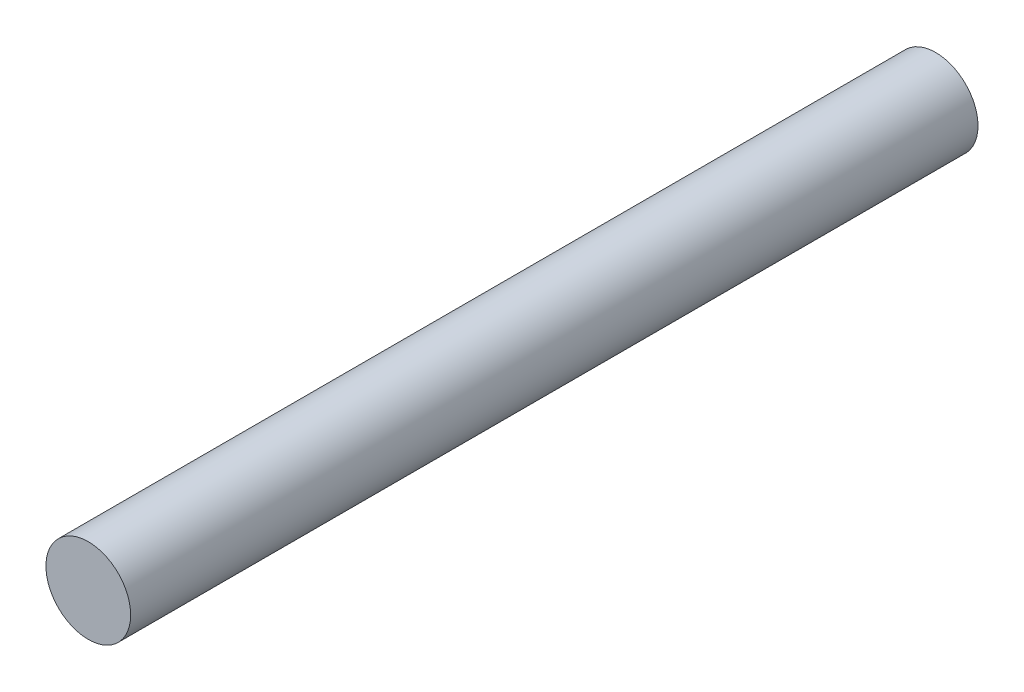
ISO-10303-21;
HEADER;
FILE_DESCRIPTION(('STEP AP214'),'2;1');
FILE_NAME('part.step','',(''),(''),'','','');
FILE_SCHEMA(('AUTOMOTIVE_DESIGN { 1 0 10303 214 1 1 1 1 }'));
ENDSEC;
DATA;
#1=APPLICATION_CONTEXT('core data for automotive mechanical design processes');
#2=APPLICATION_PROTOCOL_DEFINITION('international standard','automotive_design',2000,#1);
#3=PRODUCT_CONTEXT('',#1,'mechanical');
#4=PRODUCT('Part','Part','',(#3));
#5=PRODUCT_RELATED_PRODUCT_CATEGORY('part','',(#4));
#6=PRODUCT_DEFINITION_FORMATION('','',#4);
#7=PRODUCT_DEFINITION_CONTEXT('part definition',#1,'design');
#8=PRODUCT_DEFINITION('design','',#6,#7);
#9=PRODUCT_DEFINITION_SHAPE('','',#8);
#10=(LENGTH_UNIT() NAMED_UNIT(*) SI_UNIT(.MILLI.,.METRE.));
#11=(NAMED_UNIT(*) PLANE_ANGLE_UNIT() SI_UNIT($,.RADIAN.));
#12=(NAMED_UNIT(*) SI_UNIT($,.STERADIAN.) SOLID_ANGLE_UNIT());
#13=UNCERTAINTY_MEASURE_WITH_UNIT(LENGTH_MEASURE(1.E-05),#10,'distance_accuracy_value','');
#14=(GEOMETRIC_REPRESENTATION_CONTEXT(3) GLOBAL_UNCERTAINTY_ASSIGNED_CONTEXT((#13)) GLOBAL_UNIT_ASSIGNED_CONTEXT((#10,
#11,#12)) REPRESENTATION_CONTEXT('',''));
#15=CARTESIAN_POINT('',(0.,0.,0.));
#16=DIRECTION('',(0.,0.,1.));
#17=DIRECTION('',(1.,0.,0.));
#18=AXIS2_PLACEMENT_3D('',#15,#16,#17);
#19=CARTESIAN_POINT('',(0.,0.,50.));
#20=DIRECTION('',(0.,0.,-1.));
#21=DIRECTION('',(-1.,0.,0.));
#22=AXIS2_PLACEMENT_3D('',#19,#20,#21);
#23=CYLINDRICAL_SURFACE('',#22,2.5);
#24=CARTESIAN_POINT('',(0.,0.,50.));
#25=DIRECTION('',(0.,0.,1.));
#26=DIRECTION('',(1.,0.,0.));
#27=AXIS2_PLACEMENT_3D('',#24,#25,#26);
#28=CIRCLE('',#27,2.5);
#29=CARTESIAN_POINT('',(2.5,0.,50.));
#30=VERTEX_POINT('',#29);
#31=EDGE_CURVE('E10',#30,#30,#28,.T.);
#32=ORIENTED_EDGE('',*,*,#31,.F.);
#33=EDGE_LOOP('',(#32));
#34=FACE_BOUND('',#33,.T.);
#35=CARTESIAN_POINT('',(0.,0.,0.));
#36=DIRECTION('',(0.,0.,1.));
#37=DIRECTION('',(1.,0.,0.));
#38=AXIS2_PLACEMENT_3D('',#35,#36,#37);
#39=CIRCLE('',#38,2.5);
#40=CARTESIAN_POINT('',(2.5,0.,0.));
#41=VERTEX_POINT('',#40);
#42=EDGE_CURVE('E35',#41,#41,#39,.T.);
#43=ORIENTED_EDGE('',*,*,#42,.T.);
#44=EDGE_LOOP('',(#43));
#45=FACE_BOUND('',#44,.T.);
#46=ADVANCED_FACE('F32',(#34,#45),#23,.T.);
#47=CARTESIAN_POINT('',(0.,0.,50.));
#48=DIRECTION('',(0.,0.,1.));
#49=DIRECTION('',(1.,0.,0.));
#50=AXIS2_PLACEMENT_3D('',#47,#48,#49);
#51=PLANE('',#50);
#52=ORIENTED_EDGE('',*,*,#31,.T.);
#53=EDGE_LOOP('',(#52));
#54=FACE_BOUND('',#53,.T.);
#55=ADVANCED_FACE('F47',(#54),#51,.T.);
#56=CARTESIAN_POINT('',(0.,0.,0.));
#57=DIRECTION('',(0.,0.,1.));
#58=DIRECTION('',(1.,0.,0.));
#59=AXIS2_PLACEMENT_3D('',#56,#57,#58);
#60=PLANE('',#59);
#61=ORIENTED_EDGE('',*,*,#42,.F.);
#62=EDGE_LOOP('',(#61));
#63=FACE_BOUND('',#62,.T.);
#64=ADVANCED_FACE('F45',(#63),#60,.F.);
#65=CLOSED_SHELL('',(#46,#55,#64));
#66=MANIFOLD_SOLID_BREP('B2',#65);
#67=ADVANCED_BREP_SHAPE_REPRESENTATION('',(#18,#66),#14);
#68=SHAPE_DEFINITION_REPRESENTATION(#9,#67);
ENDSEC;
END-ISO-10303-21;
